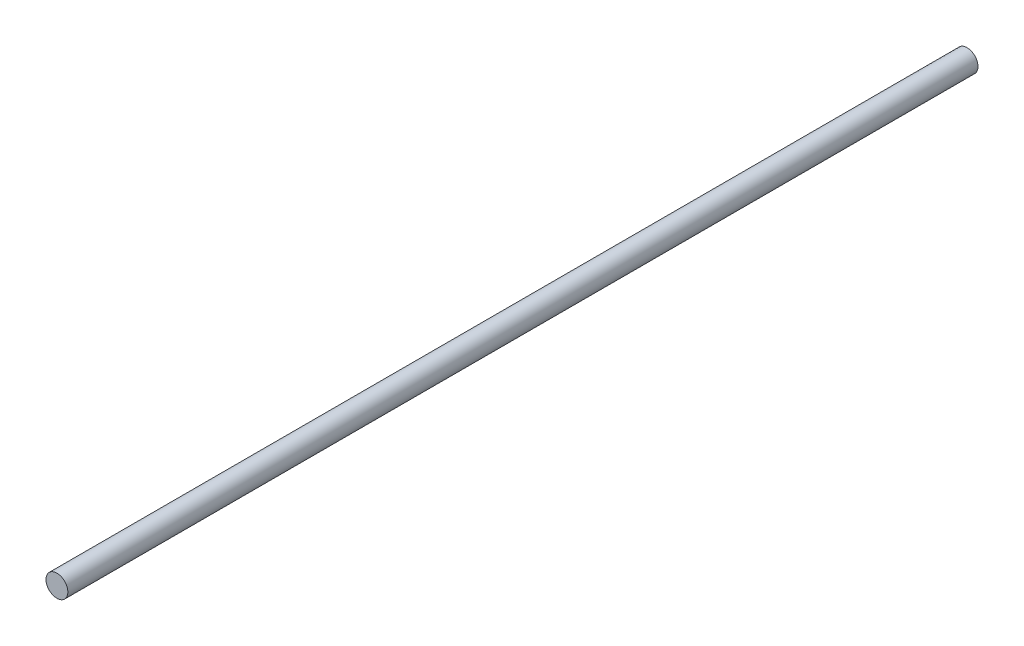
ISO-10303-21;
HEADER;
FILE_DESCRIPTION(('STEP AP214'),'2;1');
FILE_NAME('part.step','',(''),(''),'','','');
FILE_SCHEMA(('AUTOMOTIVE_DESIGN { 1 0 10303 214 1 1 1 1 }'));
ENDSEC;
DATA;
#1=APPLICATION_CONTEXT('core data for automotive mechanical design processes');
#2=APPLICATION_PROTOCOL_DEFINITION('international standard','automotive_design',2000,#1);
#3=PRODUCT_CONTEXT('',#1,'mechanical');
#4=PRODUCT('Part','Part','',(#3));
#5=PRODUCT_RELATED_PRODUCT_CATEGORY('part','',(#4));
#6=PRODUCT_DEFINITION_FORMATION('','',#4);
#7=PRODUCT_DEFINITION_CONTEXT('part definition',#1,'design');
#8=PRODUCT_DEFINITION('design','',#6,#7);
#9=PRODUCT_DEFINITION_SHAPE('','',#8);
#10=(LENGTH_UNIT() NAMED_UNIT(*) SI_UNIT(.MILLI.,.METRE.));
#11=(NAMED_UNIT(*) PLANE_ANGLE_UNIT() SI_UNIT($,.RADIAN.));
#12=(NAMED_UNIT(*) SI_UNIT($,.STERADIAN.) SOLID_ANGLE_UNIT());
#13=UNCERTAINTY_MEASURE_WITH_UNIT(LENGTH_MEASURE(1.E-05),#10,'distance_accuracy_value','');
#14=(GEOMETRIC_REPRESENTATION_CONTEXT(3) GLOBAL_UNCERTAINTY_ASSIGNED_CONTEXT((#13)) GLOBAL_UNIT_ASSIGNED_CONTEXT((#10,
#11,#12)) REPRESENTATION_CONTEXT('',''));
#15=CARTESIAN_POINT('',(0.,0.,0.));
#16=DIRECTION('',(0.,0.,1.));
#17=DIRECTION('',(1.,0.,0.));
#18=AXIS2_PLACEMENT_3D('',#15,#16,#17);
#19=CARTESIAN_POINT('',(0.,0.,500.));
#20=DIRECTION('',(0.,0.,-1.));
#21=DIRECTION('',(-1.,0.,0.));
#22=AXIS2_PLACEMENT_3D('',#19,#20,#21);
#23=CYLINDRICAL_SURFACE('',#22,6.);
#24=CARTESIAN_POINT('',(0.,0.,500.));
#25=DIRECTION('',(0.,0.,1.));
#26=DIRECTION('',(1.,0.,0.));
#27=AXIS2_PLACEMENT_3D('',#24,#25,#26);
#28=CIRCLE('',#27,6.);
#29=CARTESIAN_POINT('',(6.,0.,500.));
#30=VERTEX_POINT('',#29);
#31=EDGE_CURVE('E10',#30,#30,#28,.T.);
#32=ORIENTED_EDGE('',*,*,#31,.F.);
#33=EDGE_LOOP('',(#32));
#34=FACE_BOUND('',#33,.T.);
#35=CARTESIAN_POINT('',(0.,0.,0.));
#36=DIRECTION('',(0.,0.,1.));
#37=DIRECTION('',(1.,0.,0.));
#38=AXIS2_PLACEMENT_3D('',#35,#36,#37);
#39=CIRCLE('',#38,6.);
#40=CARTESIAN_POINT('',(6.,0.,0.));
#41=VERTEX_POINT('',#40);
#42=EDGE_CURVE('E34',#41,#41,#39,.T.);
#43=ORIENTED_EDGE('',*,*,#42,.T.);
#44=EDGE_LOOP('',(#43));
#45=FACE_BOUND('',#44,.T.);
#46=ADVANCED_FACE('F31',(#34,#45),#23,.T.);
#47=CARTESIAN_POINT('',(0.,0.,500.));
#48=DIRECTION('',(0.,0.,1.));
#49=DIRECTION('',(1.,0.,0.));
#50=AXIS2_PLACEMENT_3D('',#47,#48,#49);
#51=PLANE('',#50);
#52=ORIENTED_EDGE('',*,*,#31,.T.);
#53=EDGE_LOOP('',(#52));
#54=FACE_BOUND('',#53,.T.);
#55=ADVANCED_FACE('F46',(#54),#51,.T.);
#56=CARTESIAN_POINT('',(0.,0.,0.));
#57=DIRECTION('',(0.,0.,1.));
#58=DIRECTION('',(1.,0.,0.));
#59=AXIS2_PLACEMENT_3D('',#56,#57,#58);
#60=PLANE('',#59);
#61=ORIENTED_EDGE('',*,*,#42,.F.);
#62=EDGE_LOOP('',(#61));
#63=FACE_BOUND('',#62,.T.);
#64=ADVANCED_FACE('F44',(#63),#60,.F.);
#65=CLOSED_SHELL('',(#46,#55,#64));
#66=MANIFOLD_SOLID_BREP('B2',#65);
#67=ADVANCED_BREP_SHAPE_REPRESENTATION('',(#18,#66),#14);
#68=SHAPE_DEFINITION_REPRESENTATION(#9,#67);
ENDSEC;
END-ISO-10303-21;
